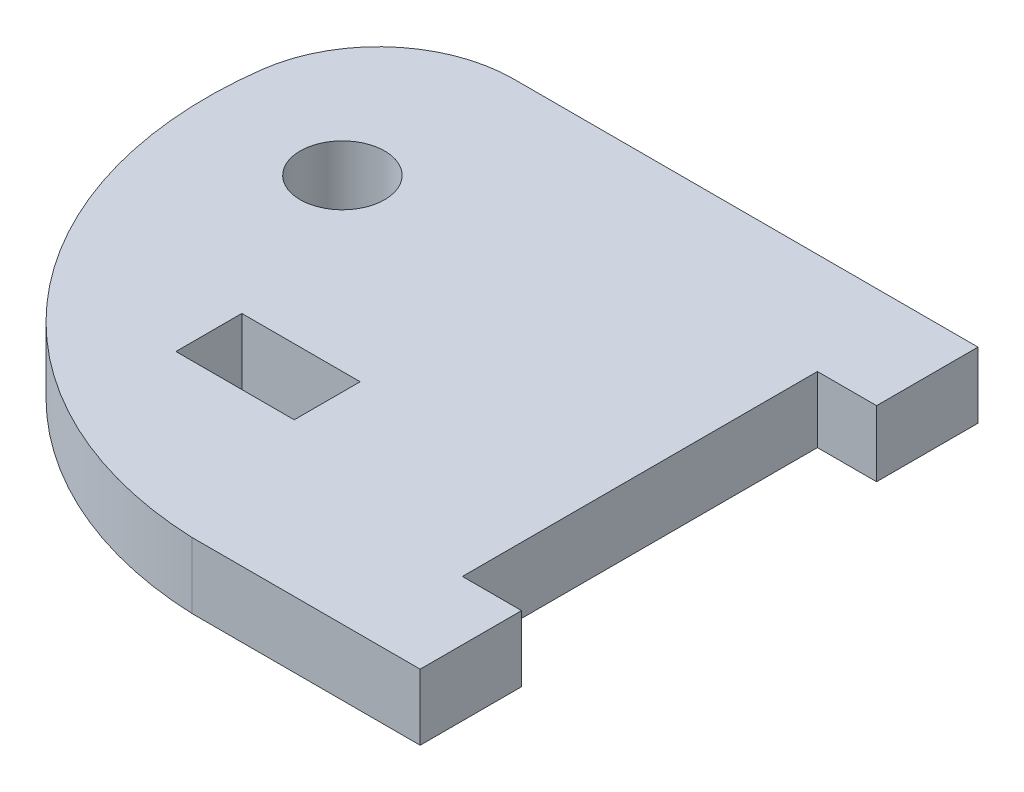
ISO-10303-21;
HEADER;
FILE_DESCRIPTION(('STEP AP214'),'2;1');
FILE_NAME('part.step','',(''),(''),'','','');
FILE_SCHEMA(('AUTOMOTIVE_DESIGN { 1 0 10303 214 1 1 1 1 }'));
ENDSEC;
DATA;
#1=APPLICATION_CONTEXT('core data for automotive mechanical design processes');
#2=APPLICATION_PROTOCOL_DEFINITION('international standard','automotive_design',2000,#1);
#3=PRODUCT_CONTEXT('',#1,'mechanical');
#4=PRODUCT('Part','Part','',(#3));
#5=PRODUCT_RELATED_PRODUCT_CATEGORY('part','',(#4));
#6=PRODUCT_DEFINITION_FORMATION('','',#4);
#7=PRODUCT_DEFINITION_CONTEXT('part definition',#1,'design');
#8=PRODUCT_DEFINITION('design','',#6,#7);
#9=PRODUCT_DEFINITION_SHAPE('','',#8);
#10=(LENGTH_UNIT() NAMED_UNIT(*) SI_UNIT(.MILLI.,.METRE.));
#11=(NAMED_UNIT(*) PLANE_ANGLE_UNIT() SI_UNIT($,.RADIAN.));
#12=(NAMED_UNIT(*) SI_UNIT($,.STERADIAN.) SOLID_ANGLE_UNIT());
#13=UNCERTAINTY_MEASURE_WITH_UNIT(LENGTH_MEASURE(1.E-05),#10,'distance_accuracy_value','');
#14=(GEOMETRIC_REPRESENTATION_CONTEXT(3) GLOBAL_UNCERTAINTY_ASSIGNED_CONTEXT((#13)) GLOBAL_UNIT_ASSIGNED_CONTEXT((#10,
#11,#12)) REPRESENTATION_CONTEXT('',''));
#15=CARTESIAN_POINT('',(0.,0.,0.));
#16=DIRECTION('',(0.,0.,1.));
#17=DIRECTION('',(1.,0.,0.));
#18=AXIS2_PLACEMENT_3D('',#15,#16,#17);
#19=CARTESIAN_POINT('',(19.0732737556561,2.4765,0.));
#20=DIRECTION('',(0.,-1.,0.));
#21=DIRECTION('',(0.,0.,-1.));
#22=AXIS2_PLACEMENT_3D('',#19,#20,#21);
#23=PLANE('',#22);
#24=DIRECTION('',(0.,0.,-1.));
#25=VECTOR('',#24,1.);
#26=CARTESIAN_POINT('',(35.052,2.4765,21.59));
#27=LINE('',#26,#25);
#28=CARTESIAN_POINT('',(35.052,2.4765,29.21));
#29=VERTEX_POINT('',#28);
#30=CARTESIAN_POINT('',(35.052,2.4765,21.59));
#31=VERTEX_POINT('',#30);
#32=EDGE_CURVE('E177',#29,#31,#27,.T.);
#33=ORIENTED_EDGE('',*,*,#32,.T.);
#34=DIRECTION('',(-1.,0.,0.));
#35=VECTOR('',#34,1.);
#36=CARTESIAN_POINT('',(30.607,2.4765,21.59));
#37=LINE('',#36,#35);
#38=CARTESIAN_POINT('',(30.607,2.4765,21.59));
#39=VERTEX_POINT('',#38);
#40=EDGE_CURVE('E180',#31,#39,#37,.T.);
#41=ORIENTED_EDGE('',*,*,#40,.T.);
#42=DIRECTION('',(0.,0.,-1.));
#43=VECTOR('',#42,1.);
#44=CARTESIAN_POINT('',(30.607,2.4765,21.59));
#45=LINE('',#44,#43);
#46=CARTESIAN_POINT('',(30.607,2.4765,-5.08000000000001));
#47=VERTEX_POINT('',#46);
#48=EDGE_CURVE('E183',#39,#47,#45,.T.);
#49=ORIENTED_EDGE('',*,*,#48,.T.);
#50=DIRECTION('',(1.,0.,0.));
#51=VECTOR('',#50,1.);
#52=CARTESIAN_POINT('',(30.607,2.4765,-5.08000000000001));
#53=LINE('',#52,#51);
#54=CARTESIAN_POINT('',(35.052,2.4765,-5.08000000000001));
#55=VERTEX_POINT('',#54);
#56=EDGE_CURVE('E185',#47,#55,#53,.T.);
#57=ORIENTED_EDGE('',*,*,#56,.T.);
#58=DIRECTION('',(0.,0.,-1.));
#59=VECTOR('',#58,1.);
#60=CARTESIAN_POINT('',(35.052,2.4765,-12.7));
#61=LINE('',#60,#59);
#62=CARTESIAN_POINT('',(35.052,2.4765,-12.7));
#63=VERTEX_POINT('',#62);
#64=EDGE_CURVE('E187',#55,#63,#61,.T.);
#65=ORIENTED_EDGE('',*,*,#64,.T.);
#66=DIRECTION('',(-1.,0.,0.));
#67=VECTOR('',#66,1.);
#68=CARTESIAN_POINT('',(0.169883272512626,2.4765,-12.7));
#69=LINE('',#68,#67);
#70=CARTESIAN_POINT('',(0.169883272512626,2.4765,-12.7));
#71=VERTEX_POINT('',#70);
#72=EDGE_CURVE('E189',#63,#71,#69,.T.);
#73=ORIENTED_EDGE('',*,*,#72,.T.);
#74=CARTESIAN_POINT('',(0.169883272512626,2.4765,-2.54000000000001));
#75=DIRECTION('',(0.,1.,0.));
#76=DIRECTION('',(0.,0.,-1.));
#77=AXIS2_PLACEMENT_3D('',#74,#75,#76);
#78=CIRCLE('',#77,10.16);
#79=CARTESIAN_POINT('',(-9.8996228735827,2.4765,-3.89301366354832));
#80=VERTEX_POINT('',#79);
#81=EDGE_CURVE('E191',#71,#80,#78,.T.);
#82=ORIENTED_EDGE('',*,*,#81,.T.);
#83=CARTESIAN_POINT('',(19.0732737556561,2.4765,0.));
#84=DIRECTION('',(0.,1.,0.));
#85=DIRECTION('',(0.,0.,-1.));
#86=AXIS2_PLACEMENT_3D('',#83,#84,#85);
#87=CIRCLE('',#86,29.2332737556561);
#88=CARTESIAN_POINT('',(17.907,2.4765,29.21));
#89=VERTEX_POINT('',#88);
#90=EDGE_CURVE('E193',#80,#89,#87,.T.);
#91=ORIENTED_EDGE('',*,*,#90,.T.);
#92=DIRECTION('',(1.,0.,0.));
#93=VECTOR('',#92,1.);
#94=CARTESIAN_POINT('',(35.052,2.4765,29.21));
#95=LINE('',#94,#93);
#96=EDGE_CURVE('E195',#89,#29,#95,.T.);
#97=ORIENTED_EDGE('',*,*,#96,.T.);
#98=EDGE_LOOP('',(#33,#41,#49,#57,#65,#73,#82,#91,#97));
#99=FACE_BOUND('',#98,.T.);
#100=DIRECTION('',(0.,0.,-1.));
#101=VECTOR('',#100,1.);
#102=CARTESIAN_POINT('',(14.097,2.4765,12.7635));
#103=LINE('',#102,#101);
#104=CARTESIAN_POINT('',(14.097,2.4765,17.7165));
#105=VERTEX_POINT('',#104);
#106=CARTESIAN_POINT('',(14.097,2.4765,12.7635));
#107=VERTEX_POINT('',#106);
#108=EDGE_CURVE('E138',#105,#107,#103,.T.);
#109=ORIENTED_EDGE('',*,*,#108,.F.);
#110=DIRECTION('',(1.,0.,0.));
#111=VECTOR('',#110,1.);
#112=CARTESIAN_POINT('',(14.097,2.4765,17.7165));
#113=LINE('',#112,#111);
#114=CARTESIAN_POINT('',(5.207,2.4765,17.7165));
#115=VERTEX_POINT('',#114);
#116=EDGE_CURVE('E161',#115,#105,#113,.T.);
#117=ORIENTED_EDGE('',*,*,#116,.F.);
#118=DIRECTION('',(0.,0.,1.));
#119=VECTOR('',#118,1.);
#120=CARTESIAN_POINT('',(5.207,2.4765,12.7635));
#121=LINE('',#120,#119);
#122=CARTESIAN_POINT('',(5.207,2.4765,12.7635));
#123=VERTEX_POINT('',#122);
#124=EDGE_CURVE('E159',#123,#115,#121,.T.);
#125=ORIENTED_EDGE('',*,*,#124,.F.);
#126=DIRECTION('',(-1.,0.,0.));
#127=VECTOR('',#126,1.);
#128=CARTESIAN_POINT('',(14.097,2.4765,12.7635));
#129=LINE('',#128,#127);
#130=EDGE_CURVE('E146',#107,#123,#129,.T.);
#131=ORIENTED_EDGE('',*,*,#130,.F.);
#132=EDGE_LOOP('',(#109,#117,#125,#131));
#133=FACE_BOUND('',#132,.T.);
#134=CARTESIAN_POINT('',(0.,2.4765,0.));
#135=DIRECTION('',(0.,1.,0.));
#136=DIRECTION('',(0.,0.,1.));
#137=AXIS2_PLACEMENT_3D('',#134,#135,#136);
#138=CIRCLE('',#137,3.175);
#139=CARTESIAN_POINT('',(0.,2.4765,3.17499999999999));
#140=VERTEX_POINT('',#139);
#141=EDGE_CURVE('E167',#140,#140,#138,.T.);
#142=ORIENTED_EDGE('',*,*,#141,.F.);
#143=EDGE_LOOP('',(#142));
#144=FACE_BOUND('',#143,.T.);
#145=ADVANCED_FACE('F43',(#99,#133,#144),#23,.F.);
#146=CARTESIAN_POINT('',(19.0732737556561,-2.4765,0.));
#147=DIRECTION('',(0.,-1.,0.));
#148=DIRECTION('',(0.,0.,-1.));
#149=AXIS2_PLACEMENT_3D('',#146,#147,#148);
#150=PLANE('',#149);
#151=DIRECTION('',(1.,0.,0.));
#152=VECTOR('',#151,1.);
#153=CARTESIAN_POINT('',(14.097,-2.4765,17.7165));
#154=LINE('',#153,#152);
#155=CARTESIAN_POINT('',(5.207,-2.4765,17.7165));
#156=VERTEX_POINT('',#155);
#157=CARTESIAN_POINT('',(14.097,-2.4765,17.7165));
#158=VERTEX_POINT('',#157);
#159=EDGE_CURVE('E147',#156,#158,#154,.T.);
#160=ORIENTED_EDGE('',*,*,#159,.T.);
#161=DIRECTION('',(0.,0.,-1.));
#162=VECTOR('',#161,1.);
#163=CARTESIAN_POINT('',(14.097,-2.4765,12.7635));
#164=LINE('',#163,#162);
#165=CARTESIAN_POINT('',(14.097,-2.4765,12.7635));
#166=VERTEX_POINT('',#165);
#167=EDGE_CURVE('E66',#158,#166,#164,.T.);
#168=ORIENTED_EDGE('',*,*,#167,.T.);
#169=DIRECTION('',(-1.,0.,0.));
#170=VECTOR('',#169,1.);
#171=CARTESIAN_POINT('',(14.097,-2.4765,12.7635));
#172=LINE('',#171,#170);
#173=CARTESIAN_POINT('',(5.207,-2.4765,12.7635));
#174=VERTEX_POINT('',#173);
#175=EDGE_CURVE('E153',#166,#174,#172,.T.);
#176=ORIENTED_EDGE('',*,*,#175,.T.);
#177=DIRECTION('',(0.,0.,1.));
#178=VECTOR('',#177,1.);
#179=CARTESIAN_POINT('',(5.207,-2.4765,12.7635));
#180=LINE('',#179,#178);
#181=EDGE_CURVE('E169',#174,#156,#180,.T.);
#182=ORIENTED_EDGE('',*,*,#181,.T.);
#183=EDGE_LOOP('',(#160,#168,#176,#182));
#184=FACE_BOUND('',#183,.T.);
#185=DIRECTION('',(0.,0.,-1.));
#186=VECTOR('',#185,1.);
#187=CARTESIAN_POINT('',(35.052,-2.4765,21.59));
#188=LINE('',#187,#186);
#189=CARTESIAN_POINT('',(35.052,-2.4765,29.21));
#190=VERTEX_POINT('',#189);
#191=CARTESIAN_POINT('',(35.052,-2.4765,21.59));
#192=VERTEX_POINT('',#191);
#193=EDGE_CURVE('E154',#190,#192,#188,.T.);
#194=ORIENTED_EDGE('',*,*,#193,.F.);
#195=DIRECTION('',(1.,0.,0.));
#196=VECTOR('',#195,1.);
#197=CARTESIAN_POINT('',(35.052,-2.4765,29.21));
#198=LINE('',#197,#196);
#199=CARTESIAN_POINT('',(17.907,-2.4765,29.21));
#200=VERTEX_POINT('',#199);
#201=EDGE_CURVE('E181',#200,#190,#198,.T.);
#202=ORIENTED_EDGE('',*,*,#201,.F.);
#203=CARTESIAN_POINT('',(19.0732737556561,-2.4765,0.));
#204=DIRECTION('',(0.,1.,0.));
#205=DIRECTION('',(0.,0.,-1.));
#206=AXIS2_PLACEMENT_3D('',#203,#204,#205);
#207=CIRCLE('',#206,29.2332737556561);
#208=CARTESIAN_POINT('',(-9.8996228735827,-2.4765,-3.89301366354832));
#209=VERTEX_POINT('',#208);
#210=EDGE_CURVE('E212',#209,#200,#207,.T.);
#211=ORIENTED_EDGE('',*,*,#210,.F.);
#212=CARTESIAN_POINT('',(0.169883272512626,-2.4765,-2.54000000000001));
#213=DIRECTION('',(0.,1.,0.));
#214=DIRECTION('',(0.,0.,-1.));
#215=AXIS2_PLACEMENT_3D('',#212,#213,#214);
#216=CIRCLE('',#215,10.16);
#217=CARTESIAN_POINT('',(0.169883272512626,-2.4765,-12.7));
#218=VERTEX_POINT('',#217);
#219=EDGE_CURVE('E210',#218,#209,#216,.T.);
#220=ORIENTED_EDGE('',*,*,#219,.F.);
#221=DIRECTION('',(-1.,0.,0.));
#222=VECTOR('',#221,1.);
#223=CARTESIAN_POINT('',(0.169883272512626,-2.4765,-12.7));
#224=LINE('',#223,#222);
#225=CARTESIAN_POINT('',(35.052,-2.4765,-12.7));
#226=VERTEX_POINT('',#225);
#227=EDGE_CURVE('E208',#226,#218,#224,.T.);
#228=ORIENTED_EDGE('',*,*,#227,.F.);
#229=DIRECTION('',(0.,0.,-1.));
#230=VECTOR('',#229,1.);
#231=CARTESIAN_POINT('',(35.052,-2.4765,-12.7));
#232=LINE('',#231,#230);
#233=CARTESIAN_POINT('',(35.052,-2.4765,-5.08000000000001));
#234=VERTEX_POINT('',#233);
#235=EDGE_CURVE('E206',#234,#226,#232,.T.);
#236=ORIENTED_EDGE('',*,*,#235,.F.);
#237=DIRECTION('',(1.,0.,0.));
#238=VECTOR('',#237,1.);
#239=CARTESIAN_POINT('',(30.607,-2.4765,-5.08000000000001));
#240=LINE('',#239,#238);
#241=CARTESIAN_POINT('',(30.607,-2.4765,-5.08000000000001));
#242=VERTEX_POINT('',#241);
#243=EDGE_CURVE('E204',#242,#234,#240,.T.);
#244=ORIENTED_EDGE('',*,*,#243,.F.);
#245=DIRECTION('',(0.,0.,-1.));
#246=VECTOR('',#245,1.);
#247=CARTESIAN_POINT('',(30.607,-2.4765,21.59));
#248=LINE('',#247,#246);
#249=CARTESIAN_POINT('',(30.607,-2.4765,21.59));
#250=VERTEX_POINT('',#249);
#251=EDGE_CURVE('E202',#250,#242,#248,.T.);
#252=ORIENTED_EDGE('',*,*,#251,.F.);
#253=DIRECTION('',(-1.,0.,0.));
#254=VECTOR('',#253,1.);
#255=CARTESIAN_POINT('',(30.607,-2.4765,21.59));
#256=LINE('',#255,#254);
#257=EDGE_CURVE('E200',#192,#250,#256,.T.);
#258=ORIENTED_EDGE('',*,*,#257,.F.);
#259=EDGE_LOOP('',(#194,#202,#211,#220,#228,#236,#244,#252,#258));
#260=FACE_BOUND('',#259,.T.);
#261=CARTESIAN_POINT('',(0.,-2.4765,0.));
#262=DIRECTION('',(0.,1.,0.));
#263=DIRECTION('',(0.,0.,1.));
#264=AXIS2_PLACEMENT_3D('',#261,#262,#263);
#265=CIRCLE('',#264,3.175);
#266=CARTESIAN_POINT('',(0.,-2.4765,3.17499999999999));
#267=VERTEX_POINT('',#266);
#268=EDGE_CURVE('E418',#267,#267,#265,.T.);
#269=ORIENTED_EDGE('',*,*,#268,.T.);
#270=EDGE_LOOP('',(#269));
#271=FACE_BOUND('',#270,.T.);
#272=ADVANCED_FACE('F245',(#184,#260,#271),#150,.T.);
#273=CARTESIAN_POINT('',(35.052,2.4765,21.59));
#274=DIRECTION('',(-1.,0.,0.));
#275=DIRECTION('',(0.,0.,1.));
#276=AXIS2_PLACEMENT_3D('',#273,#274,#275);
#277=PLANE('',#276);
#278=ORIENTED_EDGE('',*,*,#193,.T.);
#279=DIRECTION('',(0.,-1.,0.));
#280=VECTOR('',#279,1.);
#281=CARTESIAN_POINT('',(35.052,2.4765,21.59));
#282=LINE('',#281,#280);
#283=EDGE_CURVE('E13',#31,#192,#282,.T.);
#284=ORIENTED_EDGE('',*,*,#283,.F.);
#285=ORIENTED_EDGE('',*,*,#32,.F.);
#286=DIRECTION('',(0.,-1.,0.));
#287=VECTOR('',#286,1.);
#288=CARTESIAN_POINT('',(35.052,2.4765,29.21));
#289=LINE('',#288,#287);
#290=EDGE_CURVE('E197',#29,#190,#289,.T.);
#291=ORIENTED_EDGE('',*,*,#290,.T.);
#292=EDGE_LOOP('',(#278,#284,#285,#291));
#293=FACE_BOUND('',#292,.T.);
#294=ADVANCED_FACE('F45',(#293),#277,.F.);
#295=CARTESIAN_POINT('',(30.607,2.4765,21.59));
#296=DIRECTION('',(0.,0.,1.));
#297=DIRECTION('',(1.,0.,0.));
#298=AXIS2_PLACEMENT_3D('',#295,#296,#297);
#299=PLANE('',#298);
#300=ORIENTED_EDGE('',*,*,#257,.T.);
#301=DIRECTION('',(0.,-1.,0.));
#302=VECTOR('',#301,1.);
#303=CARTESIAN_POINT('',(30.607,2.4765,21.59));
#304=LINE('',#303,#302);
#305=EDGE_CURVE('E51',#39,#250,#304,.T.);
#306=ORIENTED_EDGE('',*,*,#305,.F.);
#307=ORIENTED_EDGE('',*,*,#40,.F.);
#308=ORIENTED_EDGE('',*,*,#283,.T.);
#309=EDGE_LOOP('',(#300,#306,#307,#308));
#310=FACE_BOUND('',#309,.T.);
#311=ADVANCED_FACE('F262',(#310),#299,.F.);
#312=CARTESIAN_POINT('',(30.607,2.4765,21.59));
#313=DIRECTION('',(-1.,0.,0.));
#314=DIRECTION('',(0.,0.,1.));
#315=AXIS2_PLACEMENT_3D('',#312,#313,#314);
#316=PLANE('',#315);
#317=ORIENTED_EDGE('',*,*,#251,.T.);
#318=DIRECTION('',(0.,-1.,0.));
#319=VECTOR('',#318,1.);
#320=CARTESIAN_POINT('',(30.607,2.4765,-5.08000000000001));
#321=LINE('',#320,#319);
#322=EDGE_CURVE('E232',#47,#242,#321,.T.);
#323=ORIENTED_EDGE('',*,*,#322,.F.);
#324=ORIENTED_EDGE('',*,*,#48,.F.);
#325=ORIENTED_EDGE('',*,*,#305,.T.);
#326=EDGE_LOOP('',(#317,#323,#324,#325));
#327=FACE_BOUND('',#326,.T.);
#328=ADVANCED_FACE('F239',(#327),#316,.F.);
#329=CARTESIAN_POINT('',(30.607,2.4765,-5.08000000000001));
#330=DIRECTION('',(0.,0.,-1.));
#331=DIRECTION('',(-1.,0.,0.));
#332=AXIS2_PLACEMENT_3D('',#329,#330,#331);
#333=PLANE('',#332);
#334=ORIENTED_EDGE('',*,*,#243,.T.);
#335=DIRECTION('',(0.,-1.,0.));
#336=VECTOR('',#335,1.);
#337=CARTESIAN_POINT('',(35.052,2.4765,-5.08000000000001));
#338=LINE('',#337,#336);
#339=EDGE_CURVE('E229',#55,#234,#338,.T.);
#340=ORIENTED_EDGE('',*,*,#339,.F.);
#341=ORIENTED_EDGE('',*,*,#56,.F.);
#342=ORIENTED_EDGE('',*,*,#322,.T.);
#343=EDGE_LOOP('',(#334,#340,#341,#342));
#344=FACE_BOUND('',#343,.T.);
#345=ADVANCED_FACE('F251',(#344),#333,.F.);
#346=CARTESIAN_POINT('',(35.052,2.4765,-12.7));
#347=DIRECTION('',(-1.,0.,0.));
#348=DIRECTION('',(0.,0.,1.));
#349=AXIS2_PLACEMENT_3D('',#346,#347,#348);
#350=PLANE('',#349);
#351=ORIENTED_EDGE('',*,*,#235,.T.);
#352=DIRECTION('',(0.,-1.,0.));
#353=VECTOR('',#352,1.);
#354=CARTESIAN_POINT('',(35.052,2.4765,-12.7));
#355=LINE('',#354,#353);
#356=EDGE_CURVE('E226',#63,#226,#355,.T.);
#357=ORIENTED_EDGE('',*,*,#356,.F.);
#358=ORIENTED_EDGE('',*,*,#64,.F.);
#359=ORIENTED_EDGE('',*,*,#339,.T.);
#360=EDGE_LOOP('',(#351,#357,#358,#359));
#361=FACE_BOUND('',#360,.T.);
#362=ADVANCED_FACE('F255',(#361),#350,.F.);
#363=CARTESIAN_POINT('',(0.169883272512626,2.4765,-12.7));
#364=DIRECTION('',(0.,0.,1.));
#365=DIRECTION('',(1.,0.,0.));
#366=AXIS2_PLACEMENT_3D('',#363,#364,#365);
#367=PLANE('',#366);
#368=ORIENTED_EDGE('',*,*,#227,.T.);
#369=DIRECTION('',(0.,-1.,0.));
#370=VECTOR('',#369,1.);
#371=CARTESIAN_POINT('',(0.169883272512626,2.4765,-12.7));
#372=LINE('',#371,#370);
#373=EDGE_CURVE('E223',#71,#218,#372,.T.);
#374=ORIENTED_EDGE('',*,*,#373,.F.);
#375=ORIENTED_EDGE('',*,*,#72,.F.);
#376=ORIENTED_EDGE('',*,*,#356,.T.);
#377=EDGE_LOOP('',(#368,#374,#375,#376));
#378=FACE_BOUND('',#377,.T.);
#379=ADVANCED_FACE('F280',(#378),#367,.F.);
#380=CARTESIAN_POINT('',(0.169883272512626,2.4765,-2.54000000000001));
#381=DIRECTION('',(0.,-1.,0.));
#382=DIRECTION('',(0.,0.,-1.));
#383=AXIS2_PLACEMENT_3D('',#380,#381,#382);
#384=CYLINDRICAL_SURFACE('',#383,10.16);
#385=ORIENTED_EDGE('',*,*,#219,.T.);
#386=DIRECTION('',(0.,-1.,0.));
#387=VECTOR('',#386,1.);
#388=CARTESIAN_POINT('',(-9.8996228735827,2.4765,-3.89301366354832));
#389=LINE('',#388,#387);
#390=EDGE_CURVE('E220',#80,#209,#389,.T.);
#391=ORIENTED_EDGE('',*,*,#390,.F.);
#392=ORIENTED_EDGE('',*,*,#81,.F.);
#393=ORIENTED_EDGE('',*,*,#373,.T.);
#394=EDGE_LOOP('',(#385,#391,#392,#393));
#395=FACE_BOUND('',#394,.T.);
#396=ADVANCED_FACE('F278',(#395),#384,.T.);
#397=CARTESIAN_POINT('',(19.0732737556561,2.4765,0.));
#398=DIRECTION('',(0.,-1.,0.));
#399=DIRECTION('',(0.,0.,-1.));
#400=AXIS2_PLACEMENT_3D('',#397,#398,#399);
#401=CYLINDRICAL_SURFACE('',#400,29.2332737556561);
#402=ORIENTED_EDGE('',*,*,#210,.T.);
#403=DIRECTION('',(0.,-1.,0.));
#404=VECTOR('',#403,1.);
#405=CARTESIAN_POINT('',(17.907,2.4765,29.21));
#406=LINE('',#405,#404);
#407=EDGE_CURVE('E217',#89,#200,#406,.T.);
#408=ORIENTED_EDGE('',*,*,#407,.F.);
#409=ORIENTED_EDGE('',*,*,#90,.F.);
#410=ORIENTED_EDGE('',*,*,#390,.T.);
#411=EDGE_LOOP('',(#402,#408,#409,#410));
#412=FACE_BOUND('',#411,.T.);
#413=ADVANCED_FACE('F274',(#412),#401,.T.);
#414=CARTESIAN_POINT('',(35.052,2.4765,29.21));
#415=DIRECTION('',(0.,0.,-1.));
#416=DIRECTION('',(-1.,0.,0.));
#417=AXIS2_PLACEMENT_3D('',#414,#415,#416);
#418=PLANE('',#417);
#419=ORIENTED_EDGE('',*,*,#201,.T.);
#420=ORIENTED_EDGE('',*,*,#290,.F.);
#421=ORIENTED_EDGE('',*,*,#96,.F.);
#422=ORIENTED_EDGE('',*,*,#407,.T.);
#423=EDGE_LOOP('',(#419,#420,#421,#422));
#424=FACE_BOUND('',#423,.T.);
#425=ADVANCED_FACE('F269',(#424),#418,.F.);
#426=CARTESIAN_POINT('',(14.097,2.4765,12.7635));
#427=DIRECTION('',(-1.,0.,0.));
#428=DIRECTION('',(0.,0.,1.));
#429=AXIS2_PLACEMENT_3D('',#426,#427,#428);
#430=PLANE('',#429);
#431=ORIENTED_EDGE('',*,*,#167,.F.);
#432=DIRECTION('',(0.,-1.,0.));
#433=VECTOR('',#432,1.);
#434=CARTESIAN_POINT('',(14.097,2.4765,17.7165));
#435=LINE('',#434,#433);
#436=EDGE_CURVE('E142',#105,#158,#435,.T.);
#437=ORIENTED_EDGE('',*,*,#436,.F.);
#438=ORIENTED_EDGE('',*,*,#108,.T.);
#439=DIRECTION('',(0.,-1.,0.));
#440=VECTOR('',#439,1.);
#441=CARTESIAN_POINT('',(14.097,2.4765,12.7635));
#442=LINE('',#441,#440);
#443=EDGE_CURVE('E141',#107,#166,#442,.T.);
#444=ORIENTED_EDGE('',*,*,#443,.T.);
#445=EDGE_LOOP('',(#431,#437,#438,#444));
#446=FACE_BOUND('',#445,.T.);
#447=ADVANCED_FACE('F140',(#446),#430,.T.);
#448=CARTESIAN_POINT('',(14.097,2.4765,12.7635));
#449=DIRECTION('',(0.,0.,1.));
#450=DIRECTION('',(1.,0.,0.));
#451=AXIS2_PLACEMENT_3D('',#448,#449,#450);
#452=PLANE('',#451);
#453=ORIENTED_EDGE('',*,*,#175,.F.);
#454=ORIENTED_EDGE('',*,*,#443,.F.);
#455=ORIENTED_EDGE('',*,*,#130,.T.);
#456=DIRECTION('',(0.,-1.,0.));
#457=VECTOR('',#456,1.);
#458=CARTESIAN_POINT('',(5.207,2.4765,12.7635));
#459=LINE('',#458,#457);
#460=EDGE_CURVE('E155',#123,#174,#459,.T.);
#461=ORIENTED_EDGE('',*,*,#460,.T.);
#462=EDGE_LOOP('',(#453,#454,#455,#461));
#463=FACE_BOUND('',#462,.T.);
#464=ADVANCED_FACE('F150',(#463),#452,.T.);
#465=CARTESIAN_POINT('',(5.207,2.4765,12.7635));
#466=DIRECTION('',(1.,0.,0.));
#467=DIRECTION('',(0.,0.,-1.));
#468=AXIS2_PLACEMENT_3D('',#465,#466,#467);
#469=PLANE('',#468);
#470=ORIENTED_EDGE('',*,*,#181,.F.);
#471=ORIENTED_EDGE('',*,*,#460,.F.);
#472=ORIENTED_EDGE('',*,*,#124,.T.);
#473=DIRECTION('',(0.,-1.,0.));
#474=VECTOR('',#473,1.);
#475=CARTESIAN_POINT('',(5.207,2.4765,17.7165));
#476=LINE('',#475,#474);
#477=EDGE_CURVE('E58',#115,#156,#476,.T.);
#478=ORIENTED_EDGE('',*,*,#477,.T.);
#479=EDGE_LOOP('',(#470,#471,#472,#478));
#480=FACE_BOUND('',#479,.T.);
#481=ADVANCED_FACE('F321',(#480),#469,.T.);
#482=CARTESIAN_POINT('',(14.097,2.4765,17.7165));
#483=DIRECTION('',(0.,0.,-1.));
#484=DIRECTION('',(-1.,0.,0.));
#485=AXIS2_PLACEMENT_3D('',#482,#483,#484);
#486=PLANE('',#485);
#487=ORIENTED_EDGE('',*,*,#159,.F.);
#488=ORIENTED_EDGE('',*,*,#477,.F.);
#489=ORIENTED_EDGE('',*,*,#116,.T.);
#490=ORIENTED_EDGE('',*,*,#436,.T.);
#491=EDGE_LOOP('',(#487,#488,#489,#490));
#492=FACE_BOUND('',#491,.T.);
#493=ADVANCED_FACE('F327',(#492),#486,.T.);
#494=CARTESIAN_POINT('',(0.,2.4765,0.));
#495=DIRECTION('',(0.,-1.,0.));
#496=DIRECTION('',(0.,0.,-1.));
#497=AXIS2_PLACEMENT_3D('',#494,#495,#496);
#498=CYLINDRICAL_SURFACE('',#497,3.175);
#499=ORIENTED_EDGE('',*,*,#141,.T.);
#500=EDGE_LOOP('',(#499));
#501=FACE_BOUND('',#500,.T.);
#502=ORIENTED_EDGE('',*,*,#268,.F.);
#503=EDGE_LOOP('',(#502));
#504=FACE_BOUND('',#503,.T.);
#505=ADVANCED_FACE('F335',(#501,#504),#498,.F.);
#506=CLOSED_SHELL('',(#145,#272,#294,#311,#328,#345,#362,#379,#396,#413,#425,#447,#464,#481,
#493,#505));
#507=MANIFOLD_SOLID_BREP('B2',#506);
#508=ADVANCED_BREP_SHAPE_REPRESENTATION('',(#18,#507),#14);
#509=SHAPE_DEFINITION_REPRESENTATION(#9,#508);
ENDSEC;
END-ISO-10303-21;
